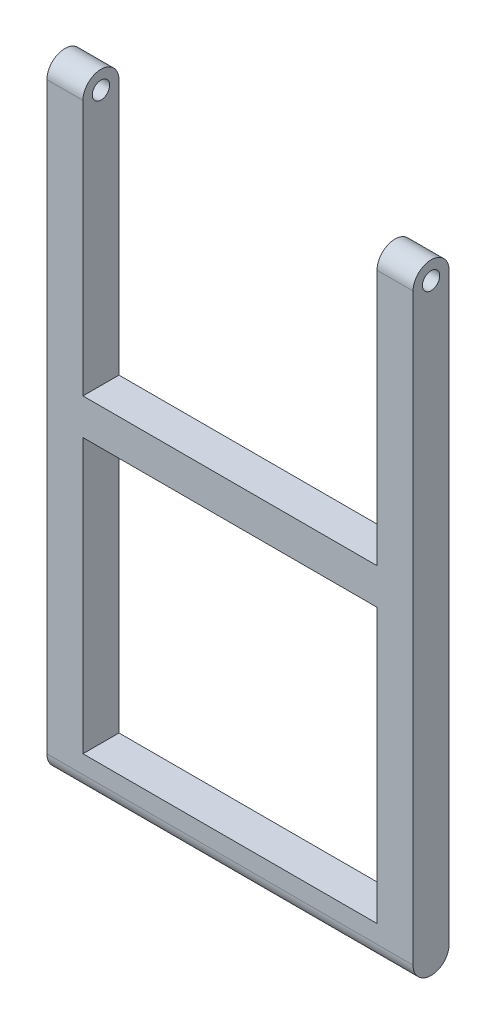
ISO-10303-21;
HEADER;
FILE_DESCRIPTION(('STEP AP214'),'2;1');
FILE_NAME('part.step','',(''),(''),'','','');
FILE_SCHEMA(('AUTOMOTIVE_DESIGN { 1 0 10303 214 1 1 1 1 }'));
ENDSEC;
DATA;
#1=APPLICATION_CONTEXT('core data for automotive mechanical design processes');
#2=APPLICATION_PROTOCOL_DEFINITION('international standard','automotive_design',2000,#1);
#3=PRODUCT_CONTEXT('',#1,'mechanical');
#4=PRODUCT('Part','Part','',(#3));
#5=PRODUCT_RELATED_PRODUCT_CATEGORY('part','',(#4));
#6=PRODUCT_DEFINITION_FORMATION('','',#4);
#7=PRODUCT_DEFINITION_CONTEXT('part definition',#1,'design');
#8=PRODUCT_DEFINITION('design','',#6,#7);
#9=PRODUCT_DEFINITION_SHAPE('','',#8);
#10=(LENGTH_UNIT() NAMED_UNIT(*) SI_UNIT(.MILLI.,.METRE.));
#11=(NAMED_UNIT(*) PLANE_ANGLE_UNIT() SI_UNIT($,.RADIAN.));
#12=(NAMED_UNIT(*) SI_UNIT($,.STERADIAN.) SOLID_ANGLE_UNIT());
#13=UNCERTAINTY_MEASURE_WITH_UNIT(LENGTH_MEASURE(1.E-05),#10,'distance_accuracy_value','');
#14=(GEOMETRIC_REPRESENTATION_CONTEXT(3) GLOBAL_UNCERTAINTY_ASSIGNED_CONTEXT((#13)) GLOBAL_UNIT_ASSIGNED_CONTEXT((#10,
#11,#12)) REPRESENTATION_CONTEXT('',''));
#15=CARTESIAN_POINT('',(0.,0.,0.));
#16=DIRECTION('',(0.,0.,1.));
#17=DIRECTION('',(1.,0.,0.));
#18=AXIS2_PLACEMENT_3D('',#15,#16,#17);
#19=CARTESIAN_POINT('',(0.,86.,5.));
#20=DIRECTION('',(1.,0.,0.));
#21=DIRECTION('',(0.,1.,0.));
#22=AXIS2_PLACEMENT_3D('',#19,#20,#21);
#23=PLANE('',#22);
#24=CARTESIAN_POINT('',(0.,83.5,2.5));
#25=DIRECTION('',(1.,0.,0.));
#26=DIRECTION('',(0.,0.,-1.));
#27=AXIS2_PLACEMENT_3D('',#24,#25,#26);
#28=CIRCLE('',#27,1.2);
#29=CARTESIAN_POINT('',(0.,83.5,1.3));
#30=VERTEX_POINT('',#29);
#31=EDGE_CURVE('E254',#30,#30,#28,.T.);
#32=ORIENTED_EDGE('',*,*,#31,.T.);
#33=EDGE_LOOP('',(#32));
#34=FACE_BOUND('',#33,.T.);
#35=DIRECTION('',(0.,-1.,0.));
#36=VECTOR('',#35,1.);
#37=CARTESIAN_POINT('',(0.,86.,0.));
#38=LINE('',#37,#36);
#39=CARTESIAN_POINT('',(0.,83.5,0.));
#40=VERTEX_POINT('',#39);
#41=CARTESIAN_POINT('',(0.,2.5,0.));
#42=VERTEX_POINT('',#41);
#43=EDGE_CURVE('E162',#40,#42,#38,.T.);
#44=ORIENTED_EDGE('',*,*,#43,.T.);
#45=CARTESIAN_POINT('',(0.,2.5,2.5));
#46=DIRECTION('',(1.,0.,0.));
#47=DIRECTION('',(0.,0.,-1.));
#48=AXIS2_PLACEMENT_3D('',#45,#46,#47);
#49=CIRCLE('',#48,2.5);
#50=CARTESIAN_POINT('',(0.,2.5,5.));
#51=VERTEX_POINT('',#50);
#52=EDGE_CURVE('E145',#51,#42,#49,.T.);
#53=ORIENTED_EDGE('',*,*,#52,.F.);
#54=DIRECTION('',(0.,-1.,0.));
#55=VECTOR('',#54,1.);
#56=CARTESIAN_POINT('',(0.,86.,5.));
#57=LINE('',#56,#55);
#58=CARTESIAN_POINT('',(0.,83.5,5.));
#59=VERTEX_POINT('',#58);
#60=EDGE_CURVE('E185',#59,#51,#57,.T.);
#61=ORIENTED_EDGE('',*,*,#60,.F.);
#62=CARTESIAN_POINT('',(0.,83.5,2.5));
#63=DIRECTION('',(1.,0.,0.));
#64=DIRECTION('',(0.,0.,-1.));
#65=AXIS2_PLACEMENT_3D('',#62,#63,#64);
#66=CIRCLE('',#65,2.5);
#67=EDGE_CURVE('E166',#40,#59,#66,.T.);
#68=ORIENTED_EDGE('',*,*,#67,.F.);
#69=EDGE_LOOP('',(#44,#53,#61,#68));
#70=FACE_BOUND('',#69,.T.);
#71=ADVANCED_FACE('F57',(#34,#70),#23,.F.);
#72=CARTESIAN_POINT('',(50.8,0.,5.));
#73=DIRECTION('',(-1.,0.,0.));
#74=DIRECTION('',(0.,0.,1.));
#75=AXIS2_PLACEMENT_3D('',#72,#73,#74);
#76=PLANE('',#75);
#77=CARTESIAN_POINT('',(50.8,83.5,2.5));
#78=DIRECTION('',(1.,0.,0.));
#79=DIRECTION('',(0.,0.,-1.));
#80=AXIS2_PLACEMENT_3D('',#77,#78,#79);
#81=CIRCLE('',#80,1.2);
#82=CARTESIAN_POINT('',(50.8,83.5,1.3));
#83=VERTEX_POINT('',#82);
#84=EDGE_CURVE('E251',#83,#83,#81,.T.);
#85=ORIENTED_EDGE('',*,*,#84,.F.);
#86=EDGE_LOOP('',(#85));
#87=FACE_BOUND('',#86,.T.);
#88=CARTESIAN_POINT('',(50.8,2.5,2.5));
#89=DIRECTION('',(1.,0.,0.));
#90=DIRECTION('',(0.,0.,-1.));
#91=AXIS2_PLACEMENT_3D('',#88,#89,#90);
#92=CIRCLE('',#91,2.5);
#93=CARTESIAN_POINT('',(50.8,2.5,5.));
#94=VERTEX_POINT('',#93);
#95=CARTESIAN_POINT('',(50.8,2.5,0.));
#96=VERTEX_POINT('',#95);
#97=EDGE_CURVE('E156',#94,#96,#92,.T.);
#98=ORIENTED_EDGE('',*,*,#97,.T.);
#99=DIRECTION('',(0.,1.,0.));
#100=VECTOR('',#99,1.);
#101=CARTESIAN_POINT('',(50.8,0.,0.));
#102=LINE('',#101,#100);
#103=CARTESIAN_POINT('',(50.8,83.5,0.));
#104=VERTEX_POINT('',#103);
#105=EDGE_CURVE('E164',#96,#104,#102,.T.);
#106=ORIENTED_EDGE('',*,*,#105,.T.);
#107=CARTESIAN_POINT('',(50.8,83.5,2.5));
#108=DIRECTION('',(1.,0.,0.));
#109=DIRECTION('',(0.,0.,-1.));
#110=AXIS2_PLACEMENT_3D('',#107,#108,#109);
#111=CIRCLE('',#110,2.5);
#112=CARTESIAN_POINT('',(50.8,83.5,5.));
#113=VERTEX_POINT('',#112);
#114=EDGE_CURVE('E242',#104,#113,#111,.T.);
#115=ORIENTED_EDGE('',*,*,#114,.T.);
#116=DIRECTION('',(0.,1.,0.));
#117=VECTOR('',#116,1.);
#118=CARTESIAN_POINT('',(50.8,0.,5.));
#119=LINE('',#118,#117);
#120=EDGE_CURVE('E208',#94,#113,#119,.T.);
#121=ORIENTED_EDGE('',*,*,#120,.F.);
#122=EDGE_LOOP('',(#98,#106,#115,#121));
#123=FACE_BOUND('',#122,.T.);
#124=ADVANCED_FACE('F260',(#87,#123),#76,.F.);
#125=CARTESIAN_POINT('',(0.,0.,0.));
#126=DIRECTION('',(0.,0.,1.));
#127=DIRECTION('',(1.,0.,0.));
#128=AXIS2_PLACEMENT_3D('',#125,#126,#127);
#129=PLANE('',#128);
#130=DIRECTION('',(0.,-1.,0.));
#131=VECTOR('',#130,1.);
#132=CARTESIAN_POINT('',(5.,43.,0.));
#133=LINE('',#132,#131);
#134=CARTESIAN_POINT('',(5.,43.,0.));
#135=VERTEX_POINT('',#134);
#136=CARTESIAN_POINT('',(5.00000000000001,5.,0.));
#137=VERTEX_POINT('',#136);
#138=EDGE_CURVE('E229',#135,#137,#133,.T.);
#139=ORIENTED_EDGE('',*,*,#138,.T.);
#140=DIRECTION('',(1.,0.,0.));
#141=VECTOR('',#140,1.);
#142=CARTESIAN_POINT('',(5.00000000000001,5.,0.));
#143=LINE('',#142,#141);
#144=CARTESIAN_POINT('',(45.8,5.,0.));
#145=VERTEX_POINT('',#144);
#146=EDGE_CURVE('E226',#137,#145,#143,.T.);
#147=ORIENTED_EDGE('',*,*,#146,.T.);
#148=DIRECTION('',(0.,1.,0.));
#149=VECTOR('',#148,1.);
#150=CARTESIAN_POINT('',(45.8,43.,0.));
#151=LINE('',#150,#149);
#152=CARTESIAN_POINT('',(45.8,43.,0.));
#153=VERTEX_POINT('',#152);
#154=EDGE_CURVE('E223',#145,#153,#151,.T.);
#155=ORIENTED_EDGE('',*,*,#154,.T.);
#156=DIRECTION('',(-1.,0.,0.));
#157=VECTOR('',#156,1.);
#158=CARTESIAN_POINT('',(5.,43.,0.));
#159=LINE('',#158,#157);
#160=EDGE_CURVE('E219',#153,#135,#159,.T.);
#161=ORIENTED_EDGE('',*,*,#160,.T.);
#162=EDGE_LOOP('',(#139,#147,#155,#161));
#163=FACE_BOUND('',#162,.T.);
#164=DIRECTION('',(1.,0.,0.));
#165=VECTOR('',#164,1.);
#166=CARTESIAN_POINT('',(0.,2.5,0.));
#167=LINE('',#166,#165);
#168=EDGE_CURVE('E148',#42,#96,#167,.T.);
#169=ORIENTED_EDGE('',*,*,#168,.F.);
#170=ORIENTED_EDGE('',*,*,#43,.F.);
#171=DIRECTION('',(1.,0.,0.));
#172=VECTOR('',#171,1.);
#173=CARTESIAN_POINT('',(0.,83.5,0.));
#174=LINE('',#173,#172);
#175=CARTESIAN_POINT('',(5.,83.5,0.));
#176=VERTEX_POINT('',#175);
#177=EDGE_CURVE('E201',#40,#176,#174,.T.);
#178=ORIENTED_EDGE('',*,*,#177,.T.);
#179=DIRECTION('',(0.,1.,0.));
#180=VECTOR('',#179,1.);
#181=CARTESIAN_POINT('',(5.00000000000001,48.,0.));
#182=LINE('',#181,#180);
#183=CARTESIAN_POINT('',(5.00000000000001,48.,0.));
#184=VERTEX_POINT('',#183);
#185=EDGE_CURVE('E182',#184,#176,#182,.T.);
#186=ORIENTED_EDGE('',*,*,#185,.F.);
#187=DIRECTION('',(-1.,0.,0.));
#188=VECTOR('',#187,1.);
#189=CARTESIAN_POINT('',(45.8,48.,0.));
#190=LINE('',#189,#188);
#191=CARTESIAN_POINT('',(45.8,48.,0.));
#192=VERTEX_POINT('',#191);
#193=EDGE_CURVE('E180',#192,#184,#190,.T.);
#194=ORIENTED_EDGE('',*,*,#193,.F.);
#195=DIRECTION('',(0.,-1.,0.));
#196=VECTOR('',#195,1.);
#197=CARTESIAN_POINT('',(45.8,86.,0.));
#198=LINE('',#197,#196);
#199=CARTESIAN_POINT('',(45.8,83.5,0.));
#200=VERTEX_POINT('',#199);
#201=EDGE_CURVE('E170',#200,#192,#198,.T.);
#202=ORIENTED_EDGE('',*,*,#201,.F.);
#203=EDGE_CURVE('E250',#200,#104,#174,.T.);
#204=ORIENTED_EDGE('',*,*,#203,.T.);
#205=ORIENTED_EDGE('',*,*,#105,.F.);
#206=EDGE_LOOP('',(#169,#170,#178,#186,#194,#202,#204,#205));
#207=FACE_BOUND('',#206,.T.);
#208=ADVANCED_FACE('F160',(#163,#207),#129,.F.);
#209=CARTESIAN_POINT('',(0.,0.,5.));
#210=DIRECTION('',(0.,0.,1.));
#211=DIRECTION('',(1.,0.,0.));
#212=AXIS2_PLACEMENT_3D('',#209,#210,#211);
#213=PLANE('',#212);
#214=DIRECTION('',(1.,0.,0.));
#215=VECTOR('',#214,1.);
#216=CARTESIAN_POINT('',(5.00000000000001,5.,5.));
#217=LINE('',#216,#215);
#218=CARTESIAN_POINT('',(5.00000000000001,5.,5.));
#219=VERTEX_POINT('',#218);
#220=CARTESIAN_POINT('',(45.8,5.,5.));
#221=VERTEX_POINT('',#220);
#222=EDGE_CURVE('E236',#219,#221,#217,.T.);
#223=ORIENTED_EDGE('',*,*,#222,.F.);
#224=DIRECTION('',(0.,-1.,0.));
#225=VECTOR('',#224,1.);
#226=CARTESIAN_POINT('',(5.,43.,5.));
#227=LINE('',#226,#225);
#228=CARTESIAN_POINT('',(5.,43.,5.));
#229=VERTEX_POINT('',#228);
#230=EDGE_CURVE('E222',#229,#219,#227,.T.);
#231=ORIENTED_EDGE('',*,*,#230,.F.);
#232=DIRECTION('',(-1.,0.,0.));
#233=VECTOR('',#232,1.);
#234=CARTESIAN_POINT('',(5.,43.,5.));
#235=LINE('',#234,#233);
#236=CARTESIAN_POINT('',(45.8,43.,5.));
#237=VERTEX_POINT('',#236);
#238=EDGE_CURVE('E218',#237,#229,#235,.T.);
#239=ORIENTED_EDGE('',*,*,#238,.F.);
#240=DIRECTION('',(0.,1.,0.));
#241=VECTOR('',#240,1.);
#242=CARTESIAN_POINT('',(45.8,43.,5.));
#243=LINE('',#242,#241);
#244=EDGE_CURVE('E234',#221,#237,#243,.T.);
#245=ORIENTED_EDGE('',*,*,#244,.F.);
#246=EDGE_LOOP('',(#223,#231,#239,#245));
#247=FACE_BOUND('',#246,.T.);
#248=ORIENTED_EDGE('',*,*,#60,.T.);
#249=DIRECTION('',(1.,0.,0.));
#250=VECTOR('',#249,1.);
#251=CARTESIAN_POINT('',(0.,2.5,5.));
#252=LINE('',#251,#250);
#253=EDGE_CURVE('E151',#51,#94,#252,.T.);
#254=ORIENTED_EDGE('',*,*,#253,.T.);
#255=ORIENTED_EDGE('',*,*,#120,.T.);
#256=DIRECTION('',(1.,0.,0.));
#257=VECTOR('',#256,1.);
#258=CARTESIAN_POINT('',(0.,83.5,5.));
#259=LINE('',#258,#257);
#260=CARTESIAN_POINT('',(45.8,83.5,5.));
#261=VERTEX_POINT('',#260);
#262=EDGE_CURVE('E241',#261,#113,#259,.T.);
#263=ORIENTED_EDGE('',*,*,#262,.F.);
#264=DIRECTION('',(0.,-1.,0.));
#265=VECTOR('',#264,1.);
#266=CARTESIAN_POINT('',(45.8,86.,5.));
#267=LINE('',#266,#265);
#268=CARTESIAN_POINT('',(45.8,48.,5.));
#269=VERTEX_POINT('',#268);
#270=EDGE_CURVE('E207',#261,#269,#267,.T.);
#271=ORIENTED_EDGE('',*,*,#270,.T.);
#272=DIRECTION('',(-1.,0.,0.));
#273=VECTOR('',#272,1.);
#274=CARTESIAN_POINT('',(45.8,48.,5.));
#275=LINE('',#274,#273);
#276=CARTESIAN_POINT('',(5.00000000000001,48.,5.));
#277=VERTEX_POINT('',#276);
#278=EDGE_CURVE('E196',#269,#277,#275,.T.);
#279=ORIENTED_EDGE('',*,*,#278,.T.);
#280=DIRECTION('',(0.,1.,0.));
#281=VECTOR('',#280,1.);
#282=CARTESIAN_POINT('',(5.00000000000001,48.,5.));
#283=LINE('',#282,#281);
#284=CARTESIAN_POINT('',(5.,83.5,5.));
#285=VERTEX_POINT('',#284);
#286=EDGE_CURVE('E176',#277,#285,#283,.T.);
#287=ORIENTED_EDGE('',*,*,#286,.T.);
#288=EDGE_CURVE('E71',#59,#285,#259,.T.);
#289=ORIENTED_EDGE('',*,*,#288,.F.);
#290=EDGE_LOOP('',(#248,#254,#255,#263,#271,#279,#287,#289));
#291=FACE_BOUND('',#290,.T.);
#292=ADVANCED_FACE('F262',(#247,#291),#213,.T.);
#293=CARTESIAN_POINT('',(45.8,86.,5.));
#294=DIRECTION('',(1.,0.,0.));
#295=DIRECTION('',(0.,1.,0.));
#296=AXIS2_PLACEMENT_3D('',#293,#294,#295);
#297=PLANE('',#296);
#298=CARTESIAN_POINT('',(45.8,83.5,2.5));
#299=DIRECTION('',(1.,0.,0.));
#300=DIRECTION('',(0.,1.,0.));
#301=AXIS2_PLACEMENT_3D('',#298,#299,#300);
#302=CIRCLE('',#301,1.2);
#303=CARTESIAN_POINT('',(45.8,84.7,2.5));
#304=VERTEX_POINT('',#303);
#305=EDGE_CURVE('E245',#304,#304,#302,.T.);
#306=ORIENTED_EDGE('',*,*,#305,.T.);
#307=EDGE_LOOP('',(#306));
#308=FACE_BOUND('',#307,.T.);
#309=CARTESIAN_POINT('',(45.8,83.5,2.5));
#310=DIRECTION('',(1.,0.,0.));
#311=DIRECTION('',(0.,1.,0.));
#312=AXIS2_PLACEMENT_3D('',#309,#310,#311);
#313=CIRCLE('',#312,2.5);
#314=EDGE_CURVE('E232',#200,#261,#313,.T.);
#315=ORIENTED_EDGE('',*,*,#314,.F.);
#316=ORIENTED_EDGE('',*,*,#201,.T.);
#317=DIRECTION('',(0.,0.,-1.));
#318=VECTOR('',#317,1.);
#319=CARTESIAN_POINT('',(45.8,48.,5.));
#320=LINE('',#319,#318);
#321=EDGE_CURVE('E65',#269,#192,#320,.T.);
#322=ORIENTED_EDGE('',*,*,#321,.F.);
#323=ORIENTED_EDGE('',*,*,#270,.F.);
#324=EDGE_LOOP('',(#315,#316,#322,#323));
#325=FACE_BOUND('',#324,.T.);
#326=ADVANCED_FACE('F268',(#308,#325),#297,.F.);
#327=CARTESIAN_POINT('',(5.00000000000001,48.,5.));
#328=DIRECTION('',(-1.,0.,0.));
#329=DIRECTION('',(0.,-1.,0.));
#330=AXIS2_PLACEMENT_3D('',#327,#328,#329);
#331=PLANE('',#330);
#332=CARTESIAN_POINT('',(5.,83.5,2.5));
#333=DIRECTION('',(-1.,0.,0.));
#334=DIRECTION('',(0.,-1.,0.));
#335=AXIS2_PLACEMENT_3D('',#332,#333,#334);
#336=CIRCLE('',#335,1.2);
#337=CARTESIAN_POINT('',(5.,82.3,2.5));
#338=VERTEX_POINT('',#337);
#339=EDGE_CURVE('E60',#338,#338,#336,.T.);
#340=ORIENTED_EDGE('',*,*,#339,.T.);
#341=EDGE_LOOP('',(#340));
#342=FACE_BOUND('',#341,.T.);
#343=ORIENTED_EDGE('',*,*,#185,.T.);
#344=CARTESIAN_POINT('',(5.,83.5,2.5));
#345=DIRECTION('',(-1.,0.,0.));
#346=DIRECTION('',(0.,-1.,0.));
#347=AXIS2_PLACEMENT_3D('',#344,#345,#346);
#348=CIRCLE('',#347,2.5);
#349=EDGE_CURVE('E12',#285,#176,#348,.T.);
#350=ORIENTED_EDGE('',*,*,#349,.F.);
#351=ORIENTED_EDGE('',*,*,#286,.F.);
#352=DIRECTION('',(0.,0.,-1.));
#353=VECTOR('',#352,1.);
#354=CARTESIAN_POINT('',(5.00000000000001,48.,5.));
#355=LINE('',#354,#353);
#356=EDGE_CURVE('E186',#277,#184,#355,.T.);
#357=ORIENTED_EDGE('',*,*,#356,.T.);
#358=EDGE_LOOP('',(#343,#350,#351,#357));
#359=FACE_BOUND('',#358,.T.);
#360=ADVANCED_FACE('F203',(#342,#359),#331,.F.);
#361=CARTESIAN_POINT('',(45.8,48.,5.));
#362=DIRECTION('',(0.,-1.,0.));
#363=DIRECTION('',(1.,0.,0.));
#364=AXIS2_PLACEMENT_3D('',#361,#362,#363);
#365=PLANE('',#364);
#366=ORIENTED_EDGE('',*,*,#193,.T.);
#367=ORIENTED_EDGE('',*,*,#356,.F.);
#368=ORIENTED_EDGE('',*,*,#278,.F.);
#369=ORIENTED_EDGE('',*,*,#321,.T.);
#370=EDGE_LOOP('',(#366,#367,#368,#369));
#371=FACE_BOUND('',#370,.T.);
#372=ADVANCED_FACE('F194',(#371),#365,.F.);
#373=CARTESIAN_POINT('',(5.,43.,5.));
#374=DIRECTION('',(1.,0.,0.));
#375=DIRECTION('',(0.,1.,0.));
#376=AXIS2_PLACEMENT_3D('',#373,#374,#375);
#377=PLANE('',#376);
#378=ORIENTED_EDGE('',*,*,#138,.F.);
#379=DIRECTION('',(0.,0.,-1.));
#380=VECTOR('',#379,1.);
#381=CARTESIAN_POINT('',(5.,43.,5.));
#382=LINE('',#381,#380);
#383=EDGE_CURVE('E215',#229,#135,#382,.T.);
#384=ORIENTED_EDGE('',*,*,#383,.F.);
#385=ORIENTED_EDGE('',*,*,#230,.T.);
#386=DIRECTION('',(0.,0.,-1.));
#387=VECTOR('',#386,1.);
#388=CARTESIAN_POINT('',(5.00000000000001,5.,5.));
#389=LINE('',#388,#387);
#390=EDGE_CURVE('E168',#219,#137,#389,.T.);
#391=ORIENTED_EDGE('',*,*,#390,.T.);
#392=EDGE_LOOP('',(#378,#384,#385,#391));
#393=FACE_BOUND('',#392,.T.);
#394=ADVANCED_FACE('F315',(#393),#377,.T.);
#395=CARTESIAN_POINT('',(5.00000000000001,5.,5.));
#396=DIRECTION('',(0.,1.,0.));
#397=DIRECTION('',(0.,0.,1.));
#398=AXIS2_PLACEMENT_3D('',#395,#396,#397);
#399=PLANE('',#398);
#400=ORIENTED_EDGE('',*,*,#146,.F.);
#401=ORIENTED_EDGE('',*,*,#390,.F.);
#402=ORIENTED_EDGE('',*,*,#222,.T.);
#403=DIRECTION('',(0.,0.,-1.));
#404=VECTOR('',#403,1.);
#405=CARTESIAN_POINT('',(45.8,5.,5.));
#406=LINE('',#405,#404);
#407=EDGE_CURVE('E173',#221,#145,#406,.T.);
#408=ORIENTED_EDGE('',*,*,#407,.T.);
#409=EDGE_LOOP('',(#400,#401,#402,#408));
#410=FACE_BOUND('',#409,.T.);
#411=ADVANCED_FACE('F311',(#410),#399,.T.);
#412=CARTESIAN_POINT('',(45.8,43.,5.));
#413=DIRECTION('',(-1.,0.,0.));
#414=DIRECTION('',(0.,-1.,0.));
#415=AXIS2_PLACEMENT_3D('',#412,#413,#414);
#416=PLANE('',#415);
#417=ORIENTED_EDGE('',*,*,#154,.F.);
#418=ORIENTED_EDGE('',*,*,#407,.F.);
#419=ORIENTED_EDGE('',*,*,#244,.T.);
#420=DIRECTION('',(0.,0.,-1.));
#421=VECTOR('',#420,1.);
#422=CARTESIAN_POINT('',(45.8,43.,5.));
#423=LINE('',#422,#421);
#424=EDGE_CURVE('E79',#237,#153,#423,.T.);
#425=ORIENTED_EDGE('',*,*,#424,.T.);
#426=EDGE_LOOP('',(#417,#418,#419,#425));
#427=FACE_BOUND('',#426,.T.);
#428=ADVANCED_FACE('F308',(#427),#416,.T.);
#429=CARTESIAN_POINT('',(5.,43.,5.));
#430=DIRECTION('',(0.,-1.,0.));
#431=DIRECTION('',(0.,0.,-1.));
#432=AXIS2_PLACEMENT_3D('',#429,#430,#431);
#433=PLANE('',#432);
#434=ORIENTED_EDGE('',*,*,#160,.F.);
#435=ORIENTED_EDGE('',*,*,#424,.F.);
#436=ORIENTED_EDGE('',*,*,#238,.T.);
#437=ORIENTED_EDGE('',*,*,#383,.T.);
#438=EDGE_LOOP('',(#434,#435,#436,#437));
#439=FACE_BOUND('',#438,.T.);
#440=ADVANCED_FACE('F305',(#439),#433,.T.);
#441=CARTESIAN_POINT('',(0.,83.5,2.5));
#442=DIRECTION('',(1.,0.,0.));
#443=DIRECTION('',(0.,0.,-1.));
#444=AXIS2_PLACEMENT_3D('',#441,#442,#443);
#445=CYLINDRICAL_SURFACE('',#444,2.5);
#446=ORIENTED_EDGE('',*,*,#349,.T.);
#447=ORIENTED_EDGE('',*,*,#177,.F.);
#448=ORIENTED_EDGE('',*,*,#67,.T.);
#449=ORIENTED_EDGE('',*,*,#288,.T.);
#450=EDGE_LOOP('',(#446,#447,#448,#449));
#451=FACE_BOUND('',#450,.T.);
#452=ADVANCED_FACE('F301',(#451),#445,.T.);
#453=ORIENTED_EDGE('',*,*,#314,.T.);
#454=ORIENTED_EDGE('',*,*,#262,.T.);
#455=ORIENTED_EDGE('',*,*,#114,.F.);
#456=ORIENTED_EDGE('',*,*,#203,.F.);
#457=EDGE_LOOP('',(#453,#454,#455,#456));
#458=FACE_BOUND('',#457,.T.);
#459=ADVANCED_FACE('F266',(#458),#445,.T.);
#460=CARTESIAN_POINT('',(0.,83.5,2.5));
#461=DIRECTION('',(1.,0.,0.));
#462=DIRECTION('',(0.,0.,-1.));
#463=AXIS2_PLACEMENT_3D('',#460,#461,#462);
#464=CYLINDRICAL_SURFACE('',#463,1.2);
#465=ORIENTED_EDGE('',*,*,#31,.F.);
#466=EDGE_LOOP('',(#465));
#467=FACE_BOUND('',#466,.T.);
#468=ORIENTED_EDGE('',*,*,#339,.F.);
#469=EDGE_LOOP('',(#468));
#470=FACE_BOUND('',#469,.T.);
#471=ADVANCED_FACE('F289',(#467,#470),#464,.F.);
#472=ORIENTED_EDGE('',*,*,#84,.T.);
#473=EDGE_LOOP('',(#472));
#474=FACE_BOUND('',#473,.T.);
#475=ORIENTED_EDGE('',*,*,#305,.F.);
#476=EDGE_LOOP('',(#475));
#477=FACE_BOUND('',#476,.T.);
#478=ADVANCED_FACE('F292',(#474,#477),#464,.F.);
#479=CARTESIAN_POINT('',(0.,2.5,2.5));
#480=DIRECTION('',(1.,0.,0.));
#481=DIRECTION('',(0.,0.,-1.));
#482=AXIS2_PLACEMENT_3D('',#479,#480,#481);
#483=CYLINDRICAL_SURFACE('',#482,2.5);
#484=ORIENTED_EDGE('',*,*,#97,.F.);
#485=ORIENTED_EDGE('',*,*,#253,.F.);
#486=ORIENTED_EDGE('',*,*,#52,.T.);
#487=ORIENTED_EDGE('',*,*,#168,.T.);
#488=EDGE_LOOP('',(#484,#485,#486,#487));
#489=FACE_BOUND('',#488,.T.);
#490=ADVANCED_FACE('F147',(#489),#483,.T.);
#491=CLOSED_SHELL('',(#71,#124,#208,#292,#326,#360,#372,#394,#411,#428,#440,#452,#459,#471,#478,#490));
#492=MANIFOLD_SOLID_BREP('B2',#491);
#493=ADVANCED_BREP_SHAPE_REPRESENTATION('',(#18,#492),#14);
#494=SHAPE_DEFINITION_REPRESENTATION(#9,#493);
ENDSEC;
END-ISO-10303-21;
